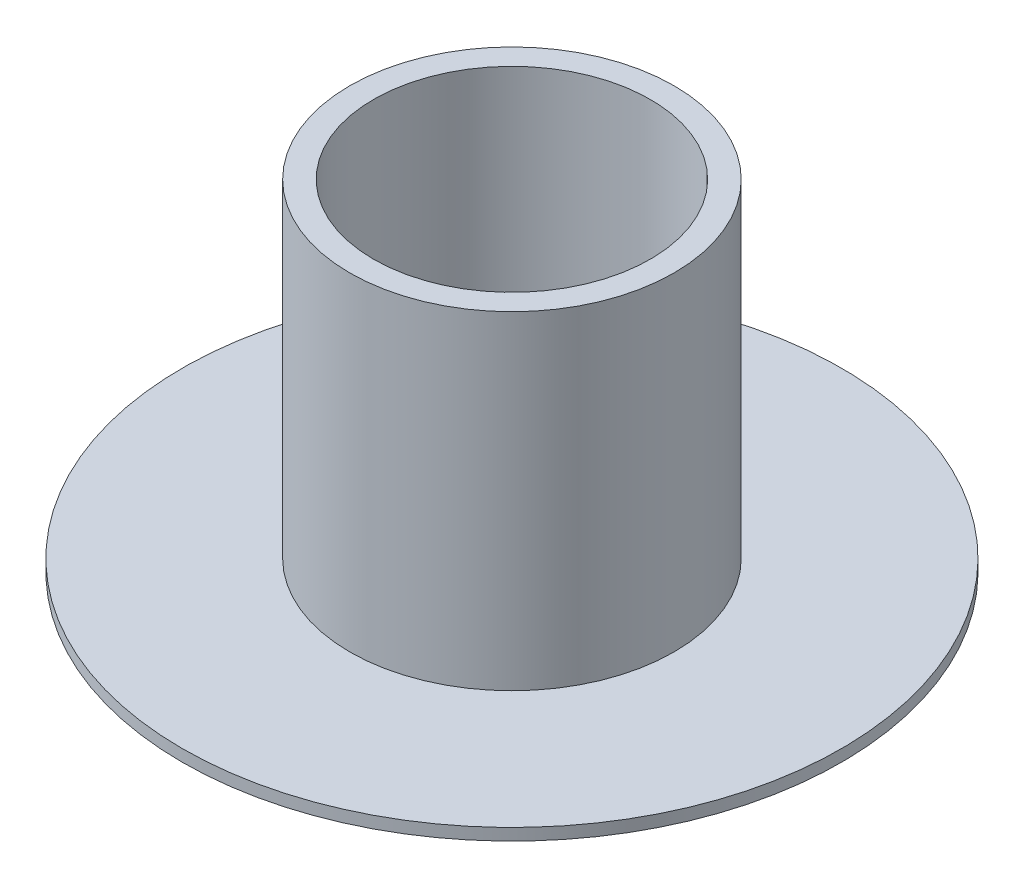
ISO-10303-21;
HEADER;
FILE_DESCRIPTION(('STEP AP214'),'2;1');
FILE_NAME('part.step','',(''),(''),'','','');
FILE_SCHEMA(('AUTOMOTIVE_DESIGN { 1 0 10303 214 1 1 1 1 }'));
ENDSEC;
DATA;
#1=APPLICATION_CONTEXT('core data for automotive mechanical design processes');
#2=APPLICATION_PROTOCOL_DEFINITION('international standard','automotive_design',2000,#1);
#3=PRODUCT_CONTEXT('',#1,'mechanical');
#4=PRODUCT('Part','Part','',(#3));
#5=PRODUCT_RELATED_PRODUCT_CATEGORY('part','',(#4));
#6=PRODUCT_DEFINITION_FORMATION('','',#4);
#7=PRODUCT_DEFINITION_CONTEXT('part definition',#1,'design');
#8=PRODUCT_DEFINITION('design','',#6,#7);
#9=PRODUCT_DEFINITION_SHAPE('','',#8);
#10=(LENGTH_UNIT() NAMED_UNIT(*) SI_UNIT(.MILLI.,.METRE.));
#11=(NAMED_UNIT(*) PLANE_ANGLE_UNIT() SI_UNIT($,.RADIAN.));
#12=(NAMED_UNIT(*) SI_UNIT($,.STERADIAN.) SOLID_ANGLE_UNIT());
#13=UNCERTAINTY_MEASURE_WITH_UNIT(LENGTH_MEASURE(1.E-05),#10,'distance_accuracy_value','');
#14=(GEOMETRIC_REPRESENTATION_CONTEXT(3) GLOBAL_UNCERTAINTY_ASSIGNED_CONTEXT((#13)) GLOBAL_UNIT_ASSIGNED_CONTEXT((#10,
#11,#12)) REPRESENTATION_CONTEXT('',''));
#15=CARTESIAN_POINT('',(0.,0.,0.));
#16=DIRECTION('',(0.,0.,1.));
#17=DIRECTION('',(1.,0.,0.));
#18=AXIS2_PLACEMENT_3D('',#15,#16,#17);
#19=CARTESIAN_POINT('',(-39.5510031353371,23.658367259882,0.));
#20=DIRECTION('',(0.,1.,0.));
#21=DIRECTION('',(0.,0.,1.));
#22=AXIS2_PLACEMENT_3D('',#19,#20,#21);
#23=CYLINDRICAL_SURFACE('',#22,10.5);
#24=CARTESIAN_POINT('',(-39.5510031353371,27.5207241232533,0.));
#25=DIRECTION('',(0.,1.,0.));
#26=DIRECTION('',(0.,0.,1.));
#27=AXIS2_PLACEMENT_3D('',#24,#25,#26);
#28=CIRCLE('',#27,10.5);
#29=CARTESIAN_POINT('',(-39.5510031353371,27.5207241232533,10.5));
#30=VERTEX_POINT('',#29);
#31=EDGE_CURVE('E53',#30,#30,#28,.T.);
#32=ORIENTED_EDGE('',*,*,#31,.T.);
#33=EDGE_LOOP('',(#32));
#34=FACE_BOUND('',#33,.T.);
#35=CARTESIAN_POINT('',(-39.5510031353371,1.72072412325327,0.));
#36=DIRECTION('',(0.,1.,0.));
#37=DIRECTION('',(0.,0.,1.));
#38=AXIS2_PLACEMENT_3D('',#35,#36,#37);
#39=CIRCLE('',#38,10.5);
#40=CARTESIAN_POINT('',(-39.5510031353371,1.72072412325327,10.5));
#41=VERTEX_POINT('',#40);
#42=EDGE_CURVE('E10',#41,#41,#39,.T.);
#43=ORIENTED_EDGE('',*,*,#42,.F.);
#44=EDGE_LOOP('',(#43));
#45=FACE_BOUND('',#44,.T.);
#46=ADVANCED_FACE('F31',(#34,#45),#23,.F.);
#47=CARTESIAN_POINT('',(-50.0510031353371,1.72072412325327,0.));
#48=DIRECTION('',(0.,-1.,0.));
#49=DIRECTION('',(0.,0.,-1.));
#50=AXIS2_PLACEMENT_3D('',#47,#48,#49);
#51=PLANE('',#50);
#52=ORIENTED_EDGE('',*,*,#42,.T.);
#53=EDGE_LOOP('',(#52));
#54=FACE_BOUND('',#53,.T.);
#55=CARTESIAN_POINT('',(-39.5510031353371,1.72072412325327,0.));
#56=DIRECTION('',(0.,1.,0.));
#57=DIRECTION('',(0.,0.,1.));
#58=AXIS2_PLACEMENT_3D('',#55,#56,#57);
#59=CIRCLE('',#58,25.);
#60=CARTESIAN_POINT('',(-39.5510031353371,1.72072412325327,25.));
#61=VERTEX_POINT('',#60);
#62=EDGE_CURVE('E37',#61,#61,#59,.T.);
#63=ORIENTED_EDGE('',*,*,#62,.F.);
#64=EDGE_LOOP('',(#63));
#65=FACE_BOUND('',#64,.T.);
#66=ADVANCED_FACE('F71',(#54,#65),#51,.T.);
#67=CARTESIAN_POINT('',(-39.5510031353371,23.658367259882,0.));
#68=DIRECTION('',(0.,1.,0.));
#69=DIRECTION('',(0.,0.,1.));
#70=AXIS2_PLACEMENT_3D('',#67,#68,#69);
#71=CYLINDRICAL_SURFACE('',#70,25.);
#72=ORIENTED_EDGE('',*,*,#62,.T.);
#73=EDGE_LOOP('',(#72));
#74=FACE_BOUND('',#73,.T.);
#75=CARTESIAN_POINT('',(-39.5510031353371,2.62072412325327,0.));
#76=DIRECTION('',(0.,1.,0.));
#77=DIRECTION('',(0.,0.,1.));
#78=AXIS2_PLACEMENT_3D('',#75,#76,#77);
#79=CIRCLE('',#78,25.);
#80=CARTESIAN_POINT('',(-39.5510031353371,2.62072412325327,25.));
#81=VERTEX_POINT('',#80);
#82=EDGE_CURVE('E41',#81,#81,#79,.T.);
#83=ORIENTED_EDGE('',*,*,#82,.F.);
#84=EDGE_LOOP('',(#83));
#85=FACE_BOUND('',#84,.T.);
#86=ADVANCED_FACE('F75',(#74,#85),#71,.T.);
#87=CARTESIAN_POINT('',(-64.5510031353371,2.62072412325327,0.));
#88=DIRECTION('',(0.,1.,0.));
#89=DIRECTION('',(0.,0.,1.));
#90=AXIS2_PLACEMENT_3D('',#87,#88,#89);
#91=PLANE('',#90);
#92=ORIENTED_EDGE('',*,*,#82,.T.);
#93=EDGE_LOOP('',(#92));
#94=FACE_BOUND('',#93,.T.);
#95=CARTESIAN_POINT('',(-39.5510031353371,2.62072412325327,0.));
#96=DIRECTION('',(0.,1.,0.));
#97=DIRECTION('',(0.,0.,1.));
#98=AXIS2_PLACEMENT_3D('',#95,#96,#97);
#99=CIRCLE('',#98,12.3);
#100=CARTESIAN_POINT('',(-39.5510031353371,2.62072412325327,12.3));
#101=VERTEX_POINT('',#100);
#102=EDGE_CURVE('E45',#101,#101,#99,.T.);
#103=ORIENTED_EDGE('',*,*,#102,.F.);
#104=EDGE_LOOP('',(#103));
#105=FACE_BOUND('',#104,.T.);
#106=ADVANCED_FACE('F67',(#94,#105),#91,.T.);
#107=CARTESIAN_POINT('',(-39.5510031353371,23.658367259882,0.));
#108=DIRECTION('',(0.,1.,0.));
#109=DIRECTION('',(0.,0.,1.));
#110=AXIS2_PLACEMENT_3D('',#107,#108,#109);
#111=CYLINDRICAL_SURFACE('',#110,12.3);
#112=ORIENTED_EDGE('',*,*,#102,.T.);
#113=EDGE_LOOP('',(#112));
#114=FACE_BOUND('',#113,.T.);
#115=CARTESIAN_POINT('',(-39.5510031353371,27.5207241232533,0.));
#116=DIRECTION('',(0.,1.,0.));
#117=DIRECTION('',(0.,0.,1.));
#118=AXIS2_PLACEMENT_3D('',#115,#116,#117);
#119=CIRCLE('',#118,12.3);
#120=CARTESIAN_POINT('',(-39.5510031353371,27.5207241232533,12.3));
#121=VERTEX_POINT('',#120);
#122=EDGE_CURVE('E50',#121,#121,#119,.T.);
#123=ORIENTED_EDGE('',*,*,#122,.F.);
#124=EDGE_LOOP('',(#123));
#125=FACE_BOUND('',#124,.T.);
#126=ADVANCED_FACE('F61',(#114,#125),#111,.T.);
#127=CARTESIAN_POINT('',(-51.8510031353371,27.5207241232533,0.));
#128=DIRECTION('',(0.,1.,0.));
#129=DIRECTION('',(0.,0.,1.));
#130=AXIS2_PLACEMENT_3D('',#127,#128,#129);
#131=PLANE('',#130);
#132=ORIENTED_EDGE('',*,*,#122,.T.);
#133=EDGE_LOOP('',(#132));
#134=FACE_BOUND('',#133,.T.);
#135=ORIENTED_EDGE('',*,*,#31,.F.);
#136=EDGE_LOOP('',(#135));
#137=FACE_BOUND('',#136,.T.);
#138=ADVANCED_FACE('F59',(#134,#137),#131,.T.);
#139=CLOSED_SHELL('',(#46,#66,#86,#106,#126,#138));
#140=MANIFOLD_SOLID_BREP('B2',#139);
#141=ADVANCED_BREP_SHAPE_REPRESENTATION('',(#18,#140),#14);
#142=SHAPE_DEFINITION_REPRESENTATION(#9,#141);
ENDSEC;
END-ISO-10303-21;
